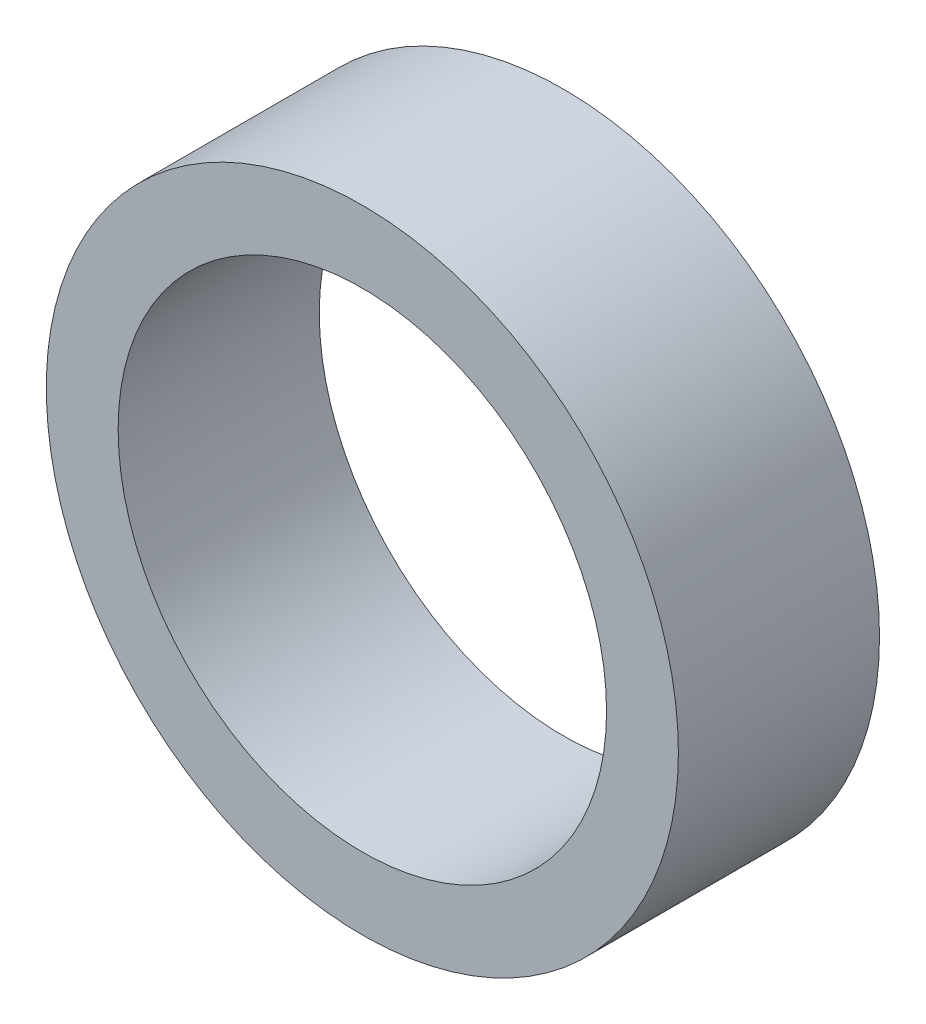
ISO-10303-21;
HEADER;
FILE_DESCRIPTION(('STEP AP214'),'2;1');
FILE_NAME('part.step','',(''),(''),'','','');
FILE_SCHEMA(('AUTOMOTIVE_DESIGN { 1 0 10303 214 1 1 1 1 }'));
ENDSEC;
DATA;
#1=APPLICATION_CONTEXT('core data for automotive mechanical design processes');
#2=APPLICATION_PROTOCOL_DEFINITION('international standard','automotive_design',2000,#1);
#3=PRODUCT_CONTEXT('',#1,'mechanical');
#4=PRODUCT('Part','Part','',(#3));
#5=PRODUCT_RELATED_PRODUCT_CATEGORY('part','',(#4));
#6=PRODUCT_DEFINITION_FORMATION('','',#4);
#7=PRODUCT_DEFINITION_CONTEXT('part definition',#1,'design');
#8=PRODUCT_DEFINITION('design','',#6,#7);
#9=PRODUCT_DEFINITION_SHAPE('','',#8);
#10=(LENGTH_UNIT() NAMED_UNIT(*) SI_UNIT(.MILLI.,.METRE.));
#11=(NAMED_UNIT(*) PLANE_ANGLE_UNIT() SI_UNIT($,.RADIAN.));
#12=(NAMED_UNIT(*) SI_UNIT($,.STERADIAN.) SOLID_ANGLE_UNIT());
#13=UNCERTAINTY_MEASURE_WITH_UNIT(LENGTH_MEASURE(1.E-05),#10,'distance_accuracy_value','');
#14=(GEOMETRIC_REPRESENTATION_CONTEXT(3) GLOBAL_UNCERTAINTY_ASSIGNED_CONTEXT((#13)) GLOBAL_UNIT_ASSIGNED_CONTEXT((#10,
#11,#12)) REPRESENTATION_CONTEXT('',''));
#15=CARTESIAN_POINT('',(0.,0.,0.));
#16=DIRECTION('',(0.,0.,1.));
#17=DIRECTION('',(1.,0.,0.));
#18=AXIS2_PLACEMENT_3D('',#15,#16,#17);
#19=CARTESIAN_POINT('',(0.,0.,7.));
#20=DIRECTION('',(0.,0.,1.));
#21=DIRECTION('',(1.,0.,0.));
#22=AXIS2_PLACEMENT_3D('',#19,#20,#21);
#23=PLANE('',#22);
#24=CARTESIAN_POINT('',(0.,0.,7.));
#25=DIRECTION('',(0.,0.,1.));
#26=DIRECTION('',(1.,0.,0.));
#27=AXIS2_PLACEMENT_3D('',#24,#25,#26);
#28=CIRCLE('',#27,11.);
#29=CARTESIAN_POINT('',(11.,0.,7.));
#30=VERTEX_POINT('',#29);
#31=EDGE_CURVE('E10',#30,#30,#28,.T.);
#32=ORIENTED_EDGE('',*,*,#31,.T.);
#33=EDGE_LOOP('',(#32));
#34=FACE_BOUND('',#33,.T.);
#35=CARTESIAN_POINT('',(0.,0.,7.));
#36=DIRECTION('',(0.,0.,1.));
#37=DIRECTION('',(1.,0.,0.));
#38=AXIS2_PLACEMENT_3D('',#35,#36,#37);
#39=CIRCLE('',#38,8.5);
#40=CARTESIAN_POINT('',(8.5,0.,7.));
#41=VERTEX_POINT('',#40);
#42=EDGE_CURVE('E48',#41,#41,#39,.T.);
#43=ORIENTED_EDGE('',*,*,#42,.F.);
#44=EDGE_LOOP('',(#43));
#45=FACE_BOUND('',#44,.T.);
#46=ADVANCED_FACE('F37',(#34,#45),#23,.T.);
#47=CARTESIAN_POINT('',(0.,0.,0.));
#48=DIRECTION('',(0.,0.,1.));
#49=DIRECTION('',(1.,0.,0.));
#50=AXIS2_PLACEMENT_3D('',#47,#48,#49);
#51=PLANE('',#50);
#52=CARTESIAN_POINT('',(0.,0.,0.));
#53=DIRECTION('',(0.,0.,1.));
#54=DIRECTION('',(1.,0.,0.));
#55=AXIS2_PLACEMENT_3D('',#52,#53,#54);
#56=CIRCLE('',#55,11.);
#57=CARTESIAN_POINT('',(11.,0.,0.));
#58=VERTEX_POINT('',#57);
#59=EDGE_CURVE('E41',#58,#58,#56,.T.);
#60=ORIENTED_EDGE('',*,*,#59,.F.);
#61=EDGE_LOOP('',(#60));
#62=FACE_BOUND('',#61,.T.);
#63=CARTESIAN_POINT('',(0.,0.,0.));
#64=DIRECTION('',(0.,0.,1.));
#65=DIRECTION('',(1.,0.,0.));
#66=AXIS2_PLACEMENT_3D('',#63,#64,#65);
#67=CIRCLE('',#66,8.5);
#68=CARTESIAN_POINT('',(8.5,0.,0.));
#69=VERTEX_POINT('',#68);
#70=EDGE_CURVE('E50',#69,#69,#67,.T.);
#71=ORIENTED_EDGE('',*,*,#70,.T.);
#72=EDGE_LOOP('',(#71));
#73=FACE_BOUND('',#72,.T.);
#74=ADVANCED_FACE('F60',(#62,#73),#51,.F.);
#75=CARTESIAN_POINT('',(0.,0.,7.));
#76=DIRECTION('',(0.,0.,-1.));
#77=DIRECTION('',(-1.,0.,0.));
#78=AXIS2_PLACEMENT_3D('',#75,#76,#77);
#79=CYLINDRICAL_SURFACE('',#78,11.);
#80=ORIENTED_EDGE('',*,*,#31,.F.);
#81=EDGE_LOOP('',(#80));
#82=FACE_BOUND('',#81,.T.);
#83=ORIENTED_EDGE('',*,*,#59,.T.);
#84=EDGE_LOOP('',(#83));
#85=FACE_BOUND('',#84,.T.);
#86=ADVANCED_FACE('F39',(#82,#85),#79,.T.);
#87=CARTESIAN_POINT('',(0.,0.,7.));
#88=DIRECTION('',(0.,0.,-1.));
#89=DIRECTION('',(-1.,0.,0.));
#90=AXIS2_PLACEMENT_3D('',#87,#88,#89);
#91=CYLINDRICAL_SURFACE('',#90,8.5);
#92=ORIENTED_EDGE('',*,*,#42,.T.);
#93=EDGE_LOOP('',(#92));
#94=FACE_BOUND('',#93,.T.);
#95=ORIENTED_EDGE('',*,*,#70,.F.);
#96=EDGE_LOOP('',(#95));
#97=FACE_BOUND('',#96,.T.);
#98=ADVANCED_FACE('F56',(#94,#97),#91,.F.);
#99=CLOSED_SHELL('',(#46,#74,#86,#98));
#100=MANIFOLD_SOLID_BREP('B2',#99);
#101=ADVANCED_BREP_SHAPE_REPRESENTATION('',(#18,#100),#14);
#102=SHAPE_DEFINITION_REPRESENTATION(#9,#101);
ENDSEC;
END-ISO-10303-21;
